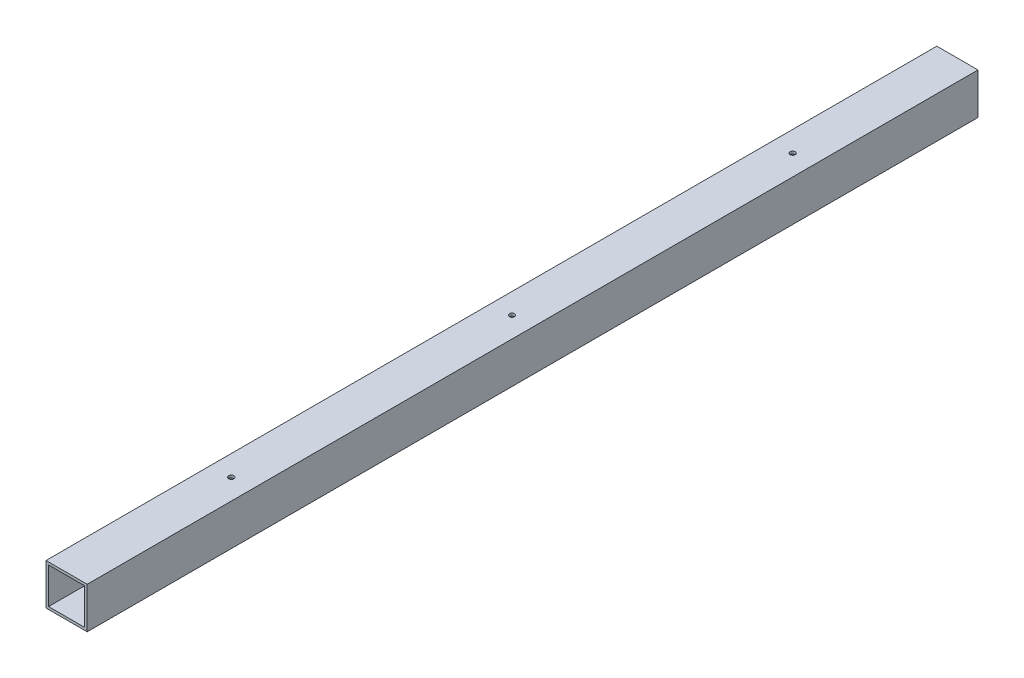
ISO-10303-21;
HEADER;
FILE_DESCRIPTION(('STEP AP214'),'2;1');
FILE_NAME('part.step','',(''),(''),'','','');
FILE_SCHEMA(('AUTOMOTIVE_DESIGN { 1 0 10303 214 1 1 1 1 }'));
ENDSEC;
DATA;
#1=APPLICATION_CONTEXT('core data for automotive mechanical design processes');
#2=APPLICATION_PROTOCOL_DEFINITION('international standard','automotive_design',2000,#1);
#3=PRODUCT_CONTEXT('',#1,'mechanical');
#4=PRODUCT('Part','Part','',(#3));
#5=PRODUCT_RELATED_PRODUCT_CATEGORY('part','',(#4));
#6=PRODUCT_DEFINITION_FORMATION('','',#4);
#7=PRODUCT_DEFINITION_CONTEXT('part definition',#1,'design');
#8=PRODUCT_DEFINITION('design','',#6,#7);
#9=PRODUCT_DEFINITION_SHAPE('','',#8);
#10=(LENGTH_UNIT() NAMED_UNIT(*) SI_UNIT(.MILLI.,.METRE.));
#11=(NAMED_UNIT(*) PLANE_ANGLE_UNIT() SI_UNIT($,.RADIAN.));
#12=(NAMED_UNIT(*) SI_UNIT($,.STERADIAN.) SOLID_ANGLE_UNIT());
#13=UNCERTAINTY_MEASURE_WITH_UNIT(LENGTH_MEASURE(1.E-05),#10,'distance_accuracy_value','');
#14=(GEOMETRIC_REPRESENTATION_CONTEXT(3) GLOBAL_UNCERTAINTY_ASSIGNED_CONTEXT((#13)) GLOBAL_UNIT_ASSIGNED_CONTEXT((#10,
#11,#12)) REPRESENTATION_CONTEXT('',''));
#15=CARTESIAN_POINT('',(0.,0.,0.));
#16=DIRECTION('',(0.,0.,1.));
#17=DIRECTION('',(1.,0.,0.));
#18=AXIS2_PLACEMENT_3D('',#15,#16,#17);
#19=CARTESIAN_POINT('',(50.8,25.4000000000002,-549.275000000001));
#20=DIRECTION('',(0.,0.,1.));
#21=DIRECTION('',(0.,-1.,0.));
#22=AXIS2_PLACEMENT_3D('',#19,#20,#21);
#23=PLANE('',#22);
#24=DIRECTION('',(0.,1.,0.));
#25=VECTOR('',#24,1.);
#26=CARTESIAN_POINT('',(47.625,-22.2249999999999,-549.275000000001));
#27=LINE('',#26,#25);
#28=CARTESIAN_POINT('',(47.625,-22.2249999999999,-549.275000000001));
#29=VERTEX_POINT('',#28);
#30=CARTESIAN_POINT('',(47.625,22.2250000000001,-549.275000000001));
#31=VERTEX_POINT('',#30);
#32=EDGE_CURVE('E110',#29,#31,#27,.T.);
#33=ORIENTED_EDGE('',*,*,#32,.T.);
#34=DIRECTION('',(-1.,0.,0.));
#35=VECTOR('',#34,1.);
#36=CARTESIAN_POINT('',(47.625,22.2250000000001,-549.275000000001));
#37=LINE('',#36,#35);
#38=CARTESIAN_POINT('',(3.17500000000015,22.2250000000001,-549.275000000001));
#39=VERTEX_POINT('',#38);
#40=EDGE_CURVE('E104',#31,#39,#37,.T.);
#41=ORIENTED_EDGE('',*,*,#40,.T.);
#42=DIRECTION('',(0.,-1.,0.));
#43=VECTOR('',#42,1.);
#44=CARTESIAN_POINT('',(3.17500000000015,22.2250000000001,-549.275000000001));
#45=LINE('',#44,#43);
#46=CARTESIAN_POINT('',(3.17500000000015,-22.225,-549.275000000002));
#47=VERTEX_POINT('',#46);
#48=EDGE_CURVE('E113',#39,#47,#45,.T.);
#49=ORIENTED_EDGE('',*,*,#48,.T.);
#50=DIRECTION('',(1.,0.,0.));
#51=VECTOR('',#50,1.);
#52=CARTESIAN_POINT('',(3.17500000000015,-22.225,-549.275000000001));
#53=LINE('',#52,#51);
#54=EDGE_CURVE('E52',#47,#29,#53,.T.);
#55=ORIENTED_EDGE('',*,*,#54,.T.);
#56=EDGE_LOOP('',(#33,#41,#49,#55));
#57=FACE_BOUND('',#56,.T.);
#58=DIRECTION('',(0.,1.,0.));
#59=VECTOR('',#58,1.);
#60=CARTESIAN_POINT('',(0.,25.4000000000001,-549.275000000001));
#61=LINE('',#60,#59);
#62=CARTESIAN_POINT('',(0.,-25.4,-549.275000000002));
#63=VERTEX_POINT('',#62);
#64=CARTESIAN_POINT('',(0.,25.4000000000001,-549.275000000001));
#65=VERTEX_POINT('',#64);
#66=EDGE_CURVE('E137',#63,#65,#61,.T.);
#67=ORIENTED_EDGE('',*,*,#66,.T.);
#68=DIRECTION('',(-1.,0.,0.));
#69=VECTOR('',#68,1.);
#70=CARTESIAN_POINT('',(50.8,25.4000000000002,-549.275000000001));
#71=LINE('',#70,#69);
#72=CARTESIAN_POINT('',(50.8,25.4000000000002,-549.275000000001));
#73=VERTEX_POINT('',#72);
#74=EDGE_CURVE('E11',#73,#65,#71,.T.);
#75=ORIENTED_EDGE('',*,*,#74,.F.);
#76=DIRECTION('',(0.,1.,0.));
#77=VECTOR('',#76,1.);
#78=CARTESIAN_POINT('',(50.8,25.4000000000002,-549.275000000001));
#79=LINE('',#78,#77);
#80=CARTESIAN_POINT('',(50.8000000000002,-25.4,-549.275000000002));
#81=VERTEX_POINT('',#80);
#82=EDGE_CURVE('E141',#81,#73,#79,.T.);
#83=ORIENTED_EDGE('',*,*,#82,.F.);
#84=DIRECTION('',(-1.,0.,0.));
#85=VECTOR('',#84,1.);
#86=CARTESIAN_POINT('',(50.8000000000002,-25.4,-549.275000000002));
#87=LINE('',#86,#85);
#88=EDGE_CURVE('E151',#81,#63,#87,.T.);
#89=ORIENTED_EDGE('',*,*,#88,.T.);
#90=EDGE_LOOP('',(#67,#75,#83,#89));
#91=FACE_BOUND('',#90,.T.);
#92=ADVANCED_FACE('F36',(#57,#91),#23,.F.);
#93=CARTESIAN_POINT('',(50.8,25.4,549.275000000002));
#94=DIRECTION('',(0.,-1.,0.));
#95=DIRECTION('',(0.,0.,-1.));
#96=AXIS2_PLACEMENT_3D('',#93,#94,#95);
#97=PLANE('',#96);
#98=CARTESIAN_POINT('',(25.4000000000001,25.4,346.075000000002));
#99=DIRECTION('',(0.,1.,0.));
#100=DIRECTION('',(0.,0.,1.));
#101=AXIS2_PLACEMENT_3D('',#98,#99,#100);
#102=CIRCLE('',#101,3.302);
#103=CARTESIAN_POINT('',(25.4000000000001,25.4,349.377000000002));
#104=VERTEX_POINT('',#103);
#105=EDGE_CURVE('E193',#104,#104,#102,.T.);
#106=ORIENTED_EDGE('',*,*,#105,.F.);
#107=EDGE_LOOP('',(#106));
#108=FACE_BOUND('',#107,.T.);
#109=CARTESIAN_POINT('',(25.3999999999999,25.4000000000001,0.));
#110=DIRECTION('',(0.,1.,0.));
#111=DIRECTION('',(0.,0.,1.));
#112=AXIS2_PLACEMENT_3D('',#109,#110,#111);
#113=CIRCLE('',#112,3.175);
#114=CARTESIAN_POINT('',(25.3999999999999,25.4000000000001,3.17500000000001));
#115=VERTEX_POINT('',#114);
#116=EDGE_CURVE('E187',#115,#115,#113,.T.);
#117=ORIENTED_EDGE('',*,*,#116,.F.);
#118=EDGE_LOOP('',(#117));
#119=FACE_BOUND('',#118,.T.);
#120=CARTESIAN_POINT('',(25.3999999999999,25.4000000000001,-346.075000000001));
#121=DIRECTION('',(0.,1.,0.));
#122=DIRECTION('',(0.,0.,1.));
#123=AXIS2_PLACEMENT_3D('',#120,#121,#122);
#124=CIRCLE('',#123,3.175);
#125=CARTESIAN_POINT('',(25.3999999999999,25.4000000000001,-342.900000000001));
#126=VERTEX_POINT('',#125);
#127=EDGE_CURVE('E181',#126,#126,#124,.T.);
#128=ORIENTED_EDGE('',*,*,#127,.F.);
#129=EDGE_LOOP('',(#128));
#130=FACE_BOUND('',#129,.T.);
#131=DIRECTION('',(0.,0.,1.));
#132=VECTOR('',#131,1.);
#133=CARTESIAN_POINT('',(0.,25.4,549.275000000002));
#134=LINE('',#133,#132);
#135=CARTESIAN_POINT('',(0.,25.4,549.275000000002));
#136=VERTEX_POINT('',#135);
#137=EDGE_CURVE('E154',#65,#136,#134,.T.);
#138=ORIENTED_EDGE('',*,*,#137,.T.);
#139=DIRECTION('',(-1.,0.,0.));
#140=VECTOR('',#139,1.);
#141=CARTESIAN_POINT('',(50.8,25.4,549.275000000002));
#142=LINE('',#141,#140);
#143=CARTESIAN_POINT('',(50.8,25.4,549.275000000002));
#144=VERTEX_POINT('',#143);
#145=EDGE_CURVE('E44',#144,#136,#142,.T.);
#146=ORIENTED_EDGE('',*,*,#145,.F.);
#147=DIRECTION('',(0.,0.,1.));
#148=VECTOR('',#147,1.);
#149=CARTESIAN_POINT('',(50.8,25.4,549.275000000002));
#150=LINE('',#149,#148);
#151=EDGE_CURVE('E144',#73,#144,#150,.T.);
#152=ORIENTED_EDGE('',*,*,#151,.F.);
#153=ORIENTED_EDGE('',*,*,#74,.T.);
#154=EDGE_LOOP('',(#138,#146,#152,#153));
#155=FACE_BOUND('',#154,.T.);
#156=ADVANCED_FACE('F226',(#108,#119,#130,#155),#97,.F.);
#157=CARTESIAN_POINT('',(50.8,25.4,549.275000000002));
#158=DIRECTION('',(0.,0.,-1.));
#159=DIRECTION('',(-1.,0.,0.));
#160=AXIS2_PLACEMENT_3D('',#157,#158,#159);
#161=PLANE('',#160);
#162=DIRECTION('',(0.,-1.,0.));
#163=VECTOR('',#162,1.);
#164=CARTESIAN_POINT('',(3.17500000000015,22.225,549.275000000002));
#165=LINE('',#164,#163);
#166=CARTESIAN_POINT('',(3.17500000000015,22.225,549.275000000002));
#167=VERTEX_POINT('',#166);
#168=CARTESIAN_POINT('',(3.17500000000015,-22.2250000000001,549.275000000002));
#169=VERTEX_POINT('',#168);
#170=EDGE_CURVE('E131',#167,#169,#165,.T.);
#171=ORIENTED_EDGE('',*,*,#170,.F.);
#172=DIRECTION('',(-1.,0.,0.));
#173=VECTOR('',#172,1.);
#174=CARTESIAN_POINT('',(47.625,22.225,549.275000000002));
#175=LINE('',#174,#173);
#176=CARTESIAN_POINT('',(47.625,22.225,549.275000000002));
#177=VERTEX_POINT('',#176);
#178=EDGE_CURVE('E60',#177,#167,#175,.T.);
#179=ORIENTED_EDGE('',*,*,#178,.F.);
#180=DIRECTION('',(0.,1.,0.));
#181=VECTOR('',#180,1.);
#182=CARTESIAN_POINT('',(47.625,-22.2250000000001,549.275000000002));
#183=LINE('',#182,#181);
#184=CARTESIAN_POINT('',(47.625,-22.2250000000001,549.275000000002));
#185=VERTEX_POINT('',#184);
#186=EDGE_CURVE('E119',#185,#177,#183,.T.);
#187=ORIENTED_EDGE('',*,*,#186,.F.);
#188=DIRECTION('',(1.,0.,0.));
#189=VECTOR('',#188,1.);
#190=CARTESIAN_POINT('',(3.17500000000015,-22.2250000000001,549.275000000002));
#191=LINE('',#190,#189);
#192=EDGE_CURVE('E122',#169,#185,#191,.T.);
#193=ORIENTED_EDGE('',*,*,#192,.F.);
#194=EDGE_LOOP('',(#171,#179,#187,#193));
#195=FACE_BOUND('',#194,.T.);
#196=DIRECTION('',(0.,-1.,0.));
#197=VECTOR('',#196,1.);
#198=CARTESIAN_POINT('',(0.,25.4,549.275000000002));
#199=LINE('',#198,#197);
#200=CARTESIAN_POINT('',(0.,-25.4000000000001,549.275000000002));
#201=VERTEX_POINT('',#200);
#202=EDGE_CURVE('E156',#136,#201,#199,.T.);
#203=ORIENTED_EDGE('',*,*,#202,.T.);
#204=DIRECTION('',(-1.,0.,0.));
#205=VECTOR('',#204,1.);
#206=CARTESIAN_POINT('',(50.8,-25.4000000000001,549.275000000002));
#207=LINE('',#206,#205);
#208=CARTESIAN_POINT('',(50.8,-25.4000000000001,549.275000000002));
#209=VERTEX_POINT('',#208);
#210=EDGE_CURVE('E161',#209,#201,#207,.T.);
#211=ORIENTED_EDGE('',*,*,#210,.F.);
#212=DIRECTION('',(0.,-1.,0.));
#213=VECTOR('',#212,1.);
#214=CARTESIAN_POINT('',(50.8,25.4,549.275000000002));
#215=LINE('',#214,#213);
#216=EDGE_CURVE('E147',#144,#209,#215,.T.);
#217=ORIENTED_EDGE('',*,*,#216,.F.);
#218=ORIENTED_EDGE('',*,*,#145,.T.);
#219=EDGE_LOOP('',(#203,#211,#217,#218));
#220=FACE_BOUND('',#219,.T.);
#221=ADVANCED_FACE('F230',(#195,#220),#161,.F.);
#222=CARTESIAN_POINT('',(50.8,-25.4000000000001,549.275000000002));
#223=DIRECTION('',(0.,1.,0.));
#224=DIRECTION('',(0.,0.,1.));
#225=AXIS2_PLACEMENT_3D('',#222,#223,#224);
#226=PLANE('',#225);
#227=CARTESIAN_POINT('',(25.4000000000001,-25.4,346.075000000002));
#228=DIRECTION('',(0.,1.,0.));
#229=DIRECTION('',(0.,0.,1.));
#230=AXIS2_PLACEMENT_3D('',#227,#228,#229);
#231=CIRCLE('',#230,3.302);
#232=CARTESIAN_POINT('',(25.4000000000001,-25.4,349.377000000002));
#233=VERTEX_POINT('',#232);
#234=EDGE_CURVE('E169',#233,#233,#231,.T.);
#235=ORIENTED_EDGE('',*,*,#234,.T.);
#236=EDGE_LOOP('',(#235));
#237=FACE_BOUND('',#236,.T.);
#238=CARTESIAN_POINT('',(25.3999999999999,-25.4,0.));
#239=DIRECTION('',(0.,1.,0.));
#240=DIRECTION('',(0.,0.,1.));
#241=AXIS2_PLACEMENT_3D('',#238,#239,#240);
#242=CIRCLE('',#241,3.175);
#243=CARTESIAN_POINT('',(25.3999999999999,-25.4,3.17500000000001));
#244=VERTEX_POINT('',#243);
#245=EDGE_CURVE('E190',#244,#244,#242,.T.);
#246=ORIENTED_EDGE('',*,*,#245,.T.);
#247=EDGE_LOOP('',(#246));
#248=FACE_BOUND('',#247,.T.);
#249=CARTESIAN_POINT('',(25.3999999999999,-25.4,-346.075000000001));
#250=DIRECTION('',(0.,1.,0.));
#251=DIRECTION('',(0.,0.,1.));
#252=AXIS2_PLACEMENT_3D('',#249,#250,#251);
#253=CIRCLE('',#252,3.175);
#254=CARTESIAN_POINT('',(25.3999999999999,-25.4,-342.900000000001));
#255=VERTEX_POINT('',#254);
#256=EDGE_CURVE('E184',#255,#255,#253,.T.);
#257=ORIENTED_EDGE('',*,*,#256,.T.);
#258=EDGE_LOOP('',(#257));
#259=FACE_BOUND('',#258,.T.);
#260=DIRECTION('',(0.,0.,-1.));
#261=VECTOR('',#260,1.);
#262=CARTESIAN_POINT('',(0.,-25.4000000000001,549.275000000002));
#263=LINE('',#262,#261);
#264=EDGE_CURVE('E145',#201,#63,#263,.T.);
#265=ORIENTED_EDGE('',*,*,#264,.T.);
#266=ORIENTED_EDGE('',*,*,#88,.F.);
#267=DIRECTION('',(0.,0.,-1.));
#268=VECTOR('',#267,1.);
#269=CARTESIAN_POINT('',(50.8,-25.4000000000001,549.275000000002));
#270=LINE('',#269,#268);
#271=EDGE_CURVE('E149',#209,#81,#270,.T.);
#272=ORIENTED_EDGE('',*,*,#271,.F.);
#273=ORIENTED_EDGE('',*,*,#210,.T.);
#274=EDGE_LOOP('',(#265,#266,#272,#273));
#275=FACE_BOUND('',#274,.T.);
#276=ADVANCED_FACE('F199',(#237,#248,#259,#275),#226,.F.);
#277=CARTESIAN_POINT('',(50.8,0.,0.));
#278=DIRECTION('',(1.,0.,0.));
#279=DIRECTION('',(0.,0.,-1.));
#280=AXIS2_PLACEMENT_3D('',#277,#278,#279);
#281=PLANE('',#280);
#282=ORIENTED_EDGE('',*,*,#82,.T.);
#283=ORIENTED_EDGE('',*,*,#151,.T.);
#284=ORIENTED_EDGE('',*,*,#216,.T.);
#285=ORIENTED_EDGE('',*,*,#271,.T.);
#286=EDGE_LOOP('',(#282,#283,#284,#285));
#287=FACE_BOUND('',#286,.T.);
#288=ADVANCED_FACE('F242',(#287),#281,.T.);
#289=CARTESIAN_POINT('',(0.,0.,0.));
#290=DIRECTION('',(1.,0.,0.));
#291=DIRECTION('',(0.,0.,-1.));
#292=AXIS2_PLACEMENT_3D('',#289,#290,#291);
#293=PLANE('',#292);
#294=ORIENTED_EDGE('',*,*,#66,.F.);
#295=ORIENTED_EDGE('',*,*,#264,.F.);
#296=ORIENTED_EDGE('',*,*,#202,.F.);
#297=ORIENTED_EDGE('',*,*,#137,.F.);
#298=EDGE_LOOP('',(#294,#295,#296,#297));
#299=FACE_BOUND('',#298,.T.);
#300=ADVANCED_FACE('F243',(#299),#293,.F.);
#301=CARTESIAN_POINT('',(47.625,22.2250000000001,-549.275000000001));
#302=DIRECTION('',(0.,1.,0.));
#303=DIRECTION('',(0.,0.,1.));
#304=AXIS2_PLACEMENT_3D('',#301,#302,#303);
#305=PLANE('',#304);
#306=CARTESIAN_POINT('',(25.4000000000001,22.225,346.075000000002));
#307=DIRECTION('',(0.,1.,0.));
#308=DIRECTION('',(0.,0.,1.));
#309=AXIS2_PLACEMENT_3D('',#306,#307,#308);
#310=CIRCLE('',#309,3.302);
#311=CARTESIAN_POINT('',(25.4000000000001,22.225,349.377000000002));
#312=VERTEX_POINT('',#311);
#313=EDGE_CURVE('E125',#312,#312,#310,.T.);
#314=ORIENTED_EDGE('',*,*,#313,.T.);
#315=EDGE_LOOP('',(#314));
#316=FACE_BOUND('',#315,.T.);
#317=CARTESIAN_POINT('',(25.3999999999999,22.225,0.));
#318=DIRECTION('',(0.,1.,0.));
#319=DIRECTION('',(0.,0.,1.));
#320=AXIS2_PLACEMENT_3D('',#317,#318,#319);
#321=CIRCLE('',#320,3.175);
#322=CARTESIAN_POINT('',(25.3999999999999,22.225,3.17500000000001));
#323=VERTEX_POINT('',#322);
#324=EDGE_CURVE('E172',#323,#323,#321,.T.);
#325=ORIENTED_EDGE('',*,*,#324,.T.);
#326=EDGE_LOOP('',(#325));
#327=FACE_BOUND('',#326,.T.);
#328=CARTESIAN_POINT('',(25.3999999999999,22.2250000000001,-346.075000000001));
#329=DIRECTION('',(0.,1.,0.));
#330=DIRECTION('',(0.,0.,1.));
#331=AXIS2_PLACEMENT_3D('',#328,#329,#330);
#332=CIRCLE('',#331,3.175);
#333=CARTESIAN_POINT('',(25.3999999999999,22.2250000000001,-342.900000000001));
#334=VERTEX_POINT('',#333);
#335=EDGE_CURVE('E168',#334,#334,#332,.T.);
#336=ORIENTED_EDGE('',*,*,#335,.T.);
#337=EDGE_LOOP('',(#336));
#338=FACE_BOUND('',#337,.T.);
#339=ORIENTED_EDGE('',*,*,#178,.T.);
#340=DIRECTION('',(0.,0.,1.));
#341=VECTOR('',#340,1.);
#342=CARTESIAN_POINT('',(3.17500000000015,22.2250000000001,-549.275000000001));
#343=LINE('',#342,#341);
#344=EDGE_CURVE('E100',#39,#167,#343,.T.);
#345=ORIENTED_EDGE('',*,*,#344,.F.);
#346=ORIENTED_EDGE('',*,*,#40,.F.);
#347=DIRECTION('',(0.,0.,1.));
#348=VECTOR('',#347,1.);
#349=CARTESIAN_POINT('',(47.625,22.2250000000001,-549.275000000001));
#350=LINE('',#349,#348);
#351=EDGE_CURVE('E135',#31,#177,#350,.T.);
#352=ORIENTED_EDGE('',*,*,#351,.T.);
#353=EDGE_LOOP('',(#339,#345,#346,#352));
#354=FACE_BOUND('',#353,.T.);
#355=ADVANCED_FACE('F102',(#316,#327,#338,#354),#305,.F.);
#356=CARTESIAN_POINT('',(47.625,-22.2249999999999,-549.275000000001));
#357=DIRECTION('',(1.,0.,0.));
#358=DIRECTION('',(0.,0.,-1.));
#359=AXIS2_PLACEMENT_3D('',#356,#357,#358);
#360=PLANE('',#359);
#361=ORIENTED_EDGE('',*,*,#186,.T.);
#362=ORIENTED_EDGE('',*,*,#351,.F.);
#363=ORIENTED_EDGE('',*,*,#32,.F.);
#364=DIRECTION('',(0.,0.,1.));
#365=VECTOR('',#364,1.);
#366=CARTESIAN_POINT('',(47.625,-22.2249999999999,-549.275000000001));
#367=LINE('',#366,#365);
#368=EDGE_CURVE('E138',#29,#185,#367,.T.);
#369=ORIENTED_EDGE('',*,*,#368,.T.);
#370=EDGE_LOOP('',(#361,#362,#363,#369));
#371=FACE_BOUND('',#370,.T.);
#372=ADVANCED_FACE('F252',(#371),#360,.F.);
#373=CARTESIAN_POINT('',(3.17500000000015,-22.225,-549.275000000001));
#374=DIRECTION('',(0.,-1.,0.));
#375=DIRECTION('',(0.,0.,-1.));
#376=AXIS2_PLACEMENT_3D('',#373,#374,#375);
#377=PLANE('',#376);
#378=CARTESIAN_POINT('',(25.4000000000001,-22.2250000000001,346.075000000002));
#379=DIRECTION('',(0.,-1.,0.));
#380=DIRECTION('',(0.,0.,-1.));
#381=AXIS2_PLACEMENT_3D('',#378,#379,#380);
#382=CIRCLE('',#381,3.302);
#383=CARTESIAN_POINT('',(25.4000000000001,-22.2250000000001,342.773000000002));
#384=VERTEX_POINT('',#383);
#385=EDGE_CURVE('E39',#384,#384,#382,.T.);
#386=ORIENTED_EDGE('',*,*,#385,.T.);
#387=EDGE_LOOP('',(#386));
#388=FACE_BOUND('',#387,.T.);
#389=CARTESIAN_POINT('',(25.3999999999999,-22.225,0.));
#390=DIRECTION('',(0.,-1.,0.));
#391=DIRECTION('',(0.,0.,-1.));
#392=AXIS2_PLACEMENT_3D('',#389,#390,#391);
#393=CIRCLE('',#392,3.175);
#394=CARTESIAN_POINT('',(25.3999999999999,-22.225,-3.17500000000001));
#395=VERTEX_POINT('',#394);
#396=EDGE_CURVE('E170',#395,#395,#393,.T.);
#397=ORIENTED_EDGE('',*,*,#396,.T.);
#398=EDGE_LOOP('',(#397));
#399=FACE_BOUND('',#398,.T.);
#400=CARTESIAN_POINT('',(25.3999999999999,-22.225,-346.075000000001));
#401=DIRECTION('',(0.,-1.,0.));
#402=DIRECTION('',(0.,0.,-1.));
#403=AXIS2_PLACEMENT_3D('',#400,#401,#402);
#404=CIRCLE('',#403,3.175);
#405=CARTESIAN_POINT('',(25.3999999999999,-22.225,-349.250000000001));
#406=VERTEX_POINT('',#405);
#407=EDGE_CURVE('E166',#406,#406,#404,.T.);
#408=ORIENTED_EDGE('',*,*,#407,.T.);
#409=EDGE_LOOP('',(#408));
#410=FACE_BOUND('',#409,.T.);
#411=ORIENTED_EDGE('',*,*,#192,.T.);
#412=ORIENTED_EDGE('',*,*,#368,.F.);
#413=ORIENTED_EDGE('',*,*,#54,.F.);
#414=DIRECTION('',(0.,0.,1.));
#415=VECTOR('',#414,1.);
#416=CARTESIAN_POINT('',(3.17500000000015,-22.225,-549.275000000001));
#417=LINE('',#416,#415);
#418=EDGE_CURVE('E109',#47,#169,#417,.T.);
#419=ORIENTED_EDGE('',*,*,#418,.T.);
#420=EDGE_LOOP('',(#411,#412,#413,#419));
#421=FACE_BOUND('',#420,.T.);
#422=ADVANCED_FACE('F256',(#388,#399,#410,#421),#377,.F.);
#423=CARTESIAN_POINT('',(3.17500000000015,22.2250000000001,-549.275000000001));
#424=DIRECTION('',(-1.,0.,0.));
#425=DIRECTION('',(0.,0.,1.));
#426=AXIS2_PLACEMENT_3D('',#423,#424,#425);
#427=PLANE('',#426);
#428=ORIENTED_EDGE('',*,*,#170,.T.);
#429=ORIENTED_EDGE('',*,*,#418,.F.);
#430=ORIENTED_EDGE('',*,*,#48,.F.);
#431=ORIENTED_EDGE('',*,*,#344,.T.);
#432=EDGE_LOOP('',(#428,#429,#430,#431));
#433=FACE_BOUND('',#432,.T.);
#434=ADVANCED_FACE('F114',(#433),#427,.F.);
#435=CARTESIAN_POINT('',(25.3999999999999,-25.4,-346.075000000001));
#436=DIRECTION('',(0.,1.,0.));
#437=DIRECTION('',(0.,0.,1.));
#438=AXIS2_PLACEMENT_3D('',#435,#436,#437);
#439=CYLINDRICAL_SURFACE('',#438,3.175);
#440=ORIENTED_EDGE('',*,*,#256,.F.);
#441=EDGE_LOOP('',(#440));
#442=FACE_BOUND('',#441,.T.);
#443=ORIENTED_EDGE('',*,*,#407,.F.);
#444=EDGE_LOOP('',(#443));
#445=FACE_BOUND('',#444,.T.);
#446=ADVANCED_FACE('F255',(#442,#445),#439,.F.);
#447=CARTESIAN_POINT('',(25.3999999999999,-25.4,0.));
#448=DIRECTION('',(0.,1.,0.));
#449=DIRECTION('',(0.,0.,1.));
#450=AXIS2_PLACEMENT_3D('',#447,#448,#449);
#451=CYLINDRICAL_SURFACE('',#450,3.175);
#452=ORIENTED_EDGE('',*,*,#245,.F.);
#453=EDGE_LOOP('',(#452));
#454=FACE_BOUND('',#453,.T.);
#455=ORIENTED_EDGE('',*,*,#396,.F.);
#456=EDGE_LOOP('',(#455));
#457=FACE_BOUND('',#456,.T.);
#458=ADVANCED_FACE('F206',(#454,#457),#451,.F.);
#459=CARTESIAN_POINT('',(25.4000000000001,-25.4,346.075000000002));
#460=DIRECTION('',(0.,1.,0.));
#461=DIRECTION('',(0.,0.,1.));
#462=AXIS2_PLACEMENT_3D('',#459,#460,#461);
#463=CYLINDRICAL_SURFACE('',#462,3.302);
#464=ORIENTED_EDGE('',*,*,#234,.F.);
#465=EDGE_LOOP('',(#464));
#466=FACE_BOUND('',#465,.T.);
#467=ORIENTED_EDGE('',*,*,#385,.F.);
#468=EDGE_LOOP('',(#467));
#469=FACE_BOUND('',#468,.T.);
#470=ADVANCED_FACE('F202',(#466,#469),#463,.F.);
#471=ORIENTED_EDGE('',*,*,#127,.T.);
#472=EDGE_LOOP('',(#471));
#473=FACE_BOUND('',#472,.T.);
#474=ORIENTED_EDGE('',*,*,#335,.F.);
#475=EDGE_LOOP('',(#474));
#476=FACE_BOUND('',#475,.T.);
#477=ADVANCED_FACE('F205',(#473,#476),#439,.F.);
#478=ORIENTED_EDGE('',*,*,#116,.T.);
#479=EDGE_LOOP('',(#478));
#480=FACE_BOUND('',#479,.T.);
#481=ORIENTED_EDGE('',*,*,#324,.F.);
#482=EDGE_LOOP('',(#481));
#483=FACE_BOUND('',#482,.T.);
#484=ADVANCED_FACE('F218',(#480,#483),#451,.F.);
#485=ORIENTED_EDGE('',*,*,#105,.T.);
#486=EDGE_LOOP('',(#485));
#487=FACE_BOUND('',#486,.T.);
#488=ORIENTED_EDGE('',*,*,#313,.F.);
#489=EDGE_LOOP('',(#488));
#490=FACE_BOUND('',#489,.T.);
#491=ADVANCED_FACE('F208',(#487,#490),#463,.F.);
#492=CLOSED_SHELL('',(#92,#156,#221,#276,#288,#300,#355,#372,#422,#434,#446,#458,#470,#477,#484,#491));
#493=MANIFOLD_SOLID_BREP('B2',#492);
#494=ADVANCED_BREP_SHAPE_REPRESENTATION('',(#18,#493),#14);
#495=SHAPE_DEFINITION_REPRESENTATION(#9,#494);
ENDSEC;
END-ISO-10303-21;
